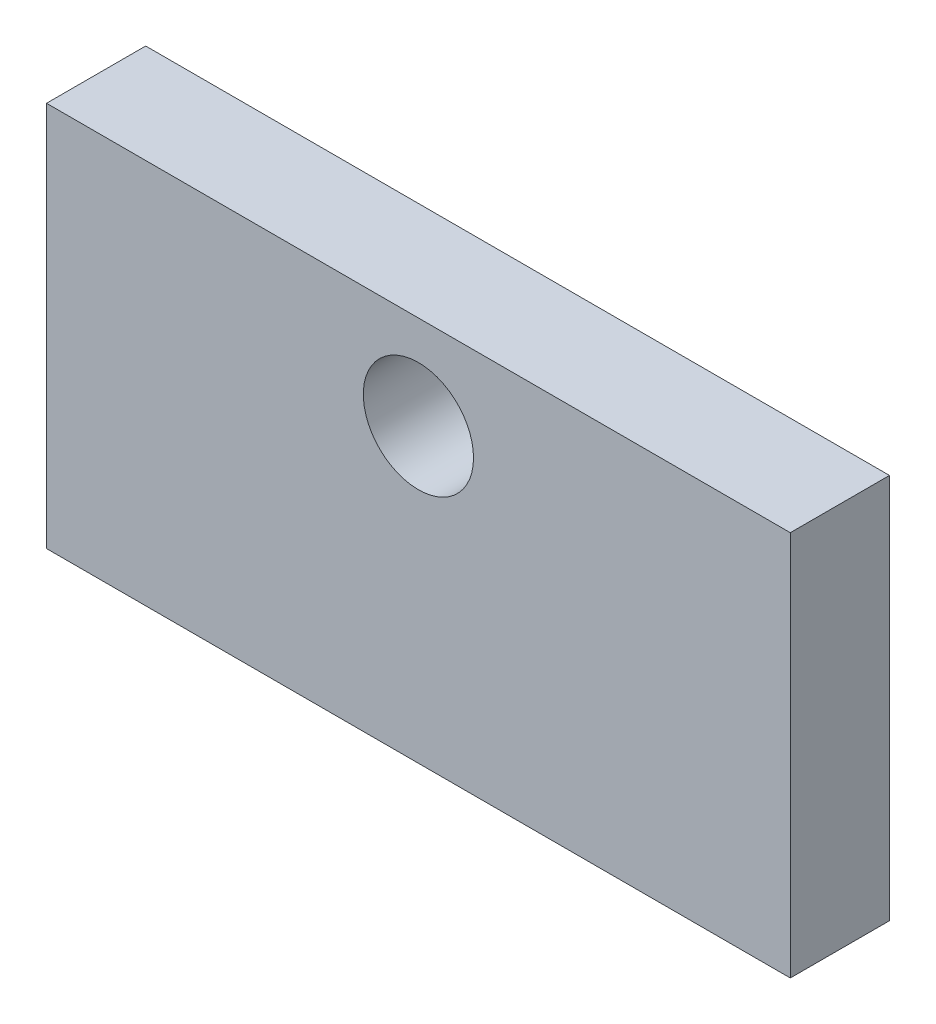
ISO-10303-21;
HEADER;
FILE_DESCRIPTION(('STEP AP214'),'2;1');
FILE_NAME('part.step','',(''),(''),'','','');
FILE_SCHEMA(('AUTOMOTIVE_DESIGN { 1 0 10303 214 1 1 1 1 }'));
ENDSEC;
DATA;
#1=APPLICATION_CONTEXT('core data for automotive mechanical design processes');
#2=APPLICATION_PROTOCOL_DEFINITION('international standard','automotive_design',2000,#1);
#3=PRODUCT_CONTEXT('',#1,'mechanical');
#4=PRODUCT('Part','Part','',(#3));
#5=PRODUCT_RELATED_PRODUCT_CATEGORY('part','',(#4));
#6=PRODUCT_DEFINITION_FORMATION('','',#4);
#7=PRODUCT_DEFINITION_CONTEXT('part definition',#1,'design');
#8=PRODUCT_DEFINITION('design','',#6,#7);
#9=PRODUCT_DEFINITION_SHAPE('','',#8);
#10=(LENGTH_UNIT() NAMED_UNIT(*) SI_UNIT(.MILLI.,.METRE.));
#11=(NAMED_UNIT(*) PLANE_ANGLE_UNIT() SI_UNIT($,.RADIAN.));
#12=(NAMED_UNIT(*) SI_UNIT($,.STERADIAN.) SOLID_ANGLE_UNIT());
#13=UNCERTAINTY_MEASURE_WITH_UNIT(LENGTH_MEASURE(1.E-05),#10,'distance_accuracy_value','');
#14=(GEOMETRIC_REPRESENTATION_CONTEXT(3) GLOBAL_UNCERTAINTY_ASSIGNED_CONTEXT((#13)) GLOBAL_UNIT_ASSIGNED_CONTEXT((#10,
#11,#12)) REPRESENTATION_CONTEXT('',''));
#15=CARTESIAN_POINT('',(0.,0.,0.));
#16=DIRECTION('',(0.,0.,1.));
#17=DIRECTION('',(1.,0.,0.));
#18=AXIS2_PLACEMENT_3D('',#15,#16,#17);
#19=CARTESIAN_POINT('',(135.,0.,18.));
#20=DIRECTION('',(0.,1.,0.));
#21=DIRECTION('',(-1.,0.,0.));
#22=AXIS2_PLACEMENT_3D('',#19,#20,#21);
#23=PLANE('',#22);
#24=DIRECTION('',(1.,0.,0.));
#25=VECTOR('',#24,1.);
#26=CARTESIAN_POINT('',(135.,0.,0.));
#27=LINE('',#26,#25);
#28=CARTESIAN_POINT('',(0.,0.,0.));
#29=VERTEX_POINT('',#28);
#30=CARTESIAN_POINT('',(135.,0.,0.));
#31=VERTEX_POINT('',#30);
#32=EDGE_CURVE('E107',#29,#31,#27,.T.);
#33=ORIENTED_EDGE('',*,*,#32,.T.);
#34=DIRECTION('',(0.,0.,-1.));
#35=VECTOR('',#34,1.);
#36=CARTESIAN_POINT('',(135.,0.,18.));
#37=LINE('',#36,#35);
#38=CARTESIAN_POINT('',(135.,0.,18.));
#39=VERTEX_POINT('',#38);
#40=EDGE_CURVE('E11',#39,#31,#37,.T.);
#41=ORIENTED_EDGE('',*,*,#40,.F.);
#42=DIRECTION('',(1.,0.,0.));
#43=VECTOR('',#42,1.);
#44=CARTESIAN_POINT('',(135.,0.,18.));
#45=LINE('',#44,#43);
#46=CARTESIAN_POINT('',(0.,0.,18.));
#47=VERTEX_POINT('',#46);
#48=EDGE_CURVE('E91',#47,#39,#45,.T.);
#49=ORIENTED_EDGE('',*,*,#48,.F.);
#50=DIRECTION('',(0.,0.,-1.));
#51=VECTOR('',#50,1.);
#52=CARTESIAN_POINT('',(0.,0.,18.));
#53=LINE('',#52,#51);
#54=EDGE_CURVE('E103',#47,#29,#53,.T.);
#55=ORIENTED_EDGE('',*,*,#54,.T.);
#56=EDGE_LOOP('',(#33,#41,#49,#55));
#57=FACE_BOUND('',#56,.T.);
#58=ADVANCED_FACE('F39',(#57),#23,.F.);
#59=CARTESIAN_POINT('',(135.,70.,18.));
#60=DIRECTION('',(-1.,0.,0.));
#61=DIRECTION('',(0.,0.,1.));
#62=AXIS2_PLACEMENT_3D('',#59,#60,#61);
#63=PLANE('',#62);
#64=DIRECTION('',(0.,1.,0.));
#65=VECTOR('',#64,1.);
#66=CARTESIAN_POINT('',(135.,70.,0.));
#67=LINE('',#66,#65);
#68=CARTESIAN_POINT('',(135.,70.,0.));
#69=VERTEX_POINT('',#68);
#70=EDGE_CURVE('E96',#31,#69,#67,.T.);
#71=ORIENTED_EDGE('',*,*,#70,.T.);
#72=DIRECTION('',(0.,0.,-1.));
#73=VECTOR('',#72,1.);
#74=CARTESIAN_POINT('',(135.,70.,18.));
#75=LINE('',#74,#73);
#76=CARTESIAN_POINT('',(135.,70.,18.));
#77=VERTEX_POINT('',#76);
#78=EDGE_CURVE('E48',#77,#69,#75,.T.);
#79=ORIENTED_EDGE('',*,*,#78,.F.);
#80=DIRECTION('',(0.,1.,0.));
#81=VECTOR('',#80,1.);
#82=CARTESIAN_POINT('',(135.,70.,18.));
#83=LINE('',#82,#81);
#84=EDGE_CURVE('E86',#39,#77,#83,.T.);
#85=ORIENTED_EDGE('',*,*,#84,.F.);
#86=ORIENTED_EDGE('',*,*,#40,.T.);
#87=EDGE_LOOP('',(#71,#79,#85,#86));
#88=FACE_BOUND('',#87,.T.);
#89=ADVANCED_FACE('F95',(#88),#63,.F.);
#90=CARTESIAN_POINT('',(0.,70.,18.));
#91=DIRECTION('',(0.,-1.,0.));
#92=DIRECTION('',(0.,0.,-1.));
#93=AXIS2_PLACEMENT_3D('',#90,#91,#92);
#94=PLANE('',#93);
#95=DIRECTION('',(-1.,0.,0.));
#96=VECTOR('',#95,1.);
#97=CARTESIAN_POINT('',(0.,70.,0.));
#98=LINE('',#97,#96);
#99=CARTESIAN_POINT('',(0.,70.,0.));
#100=VERTEX_POINT('',#99);
#101=EDGE_CURVE('E73',#69,#100,#98,.T.);
#102=ORIENTED_EDGE('',*,*,#101,.T.);
#103=DIRECTION('',(0.,0.,-1.));
#104=VECTOR('',#103,1.);
#105=CARTESIAN_POINT('',(0.,70.,18.));
#106=LINE('',#105,#104);
#107=CARTESIAN_POINT('',(0.,70.,18.));
#108=VERTEX_POINT('',#107);
#109=EDGE_CURVE('E98',#108,#100,#106,.T.);
#110=ORIENTED_EDGE('',*,*,#109,.F.);
#111=DIRECTION('',(-1.,0.,0.));
#112=VECTOR('',#111,1.);
#113=CARTESIAN_POINT('',(0.,70.,18.));
#114=LINE('',#113,#112);
#115=EDGE_CURVE('E89',#77,#108,#114,.T.);
#116=ORIENTED_EDGE('',*,*,#115,.F.);
#117=ORIENTED_EDGE('',*,*,#78,.T.);
#118=EDGE_LOOP('',(#102,#110,#116,#117));
#119=FACE_BOUND('',#118,.T.);
#120=ADVANCED_FACE('F99',(#119),#94,.F.);
#121=CARTESIAN_POINT('',(0.,0.,18.));
#122=DIRECTION('',(1.,0.,0.));
#123=DIRECTION('',(0.,0.,-1.));
#124=AXIS2_PLACEMENT_3D('',#121,#122,#123);
#125=PLANE('',#124);
#126=DIRECTION('',(0.,-1.,0.));
#127=VECTOR('',#126,1.);
#128=CARTESIAN_POINT('',(0.,0.,0.));
#129=LINE('',#128,#127);
#130=EDGE_CURVE('E79',#100,#29,#129,.T.);
#131=ORIENTED_EDGE('',*,*,#130,.T.);
#132=ORIENTED_EDGE('',*,*,#54,.F.);
#133=DIRECTION('',(0.,-1.,0.));
#134=VECTOR('',#133,1.);
#135=CARTESIAN_POINT('',(0.,0.,18.));
#136=LINE('',#135,#134);
#137=EDGE_CURVE('E56',#108,#47,#136,.T.);
#138=ORIENTED_EDGE('',*,*,#137,.F.);
#139=ORIENTED_EDGE('',*,*,#109,.T.);
#140=EDGE_LOOP('',(#131,#132,#138,#139));
#141=FACE_BOUND('',#140,.T.);
#142=ADVANCED_FACE('F121',(#141),#125,.F.);
#143=CARTESIAN_POINT('',(0.,0.,18.));
#144=DIRECTION('',(0.,0.,-1.));
#145=DIRECTION('',(-1.,0.,0.));
#146=AXIS2_PLACEMENT_3D('',#143,#144,#145);
#147=PLANE('',#146);
#148=CARTESIAN_POINT('',(67.5,53.,18.));
#149=DIRECTION('',(0.,0.,1.));
#150=DIRECTION('',(1.,0.,0.));
#151=AXIS2_PLACEMENT_3D('',#148,#149,#150);
#152=CIRCLE('',#151,9.99999999999999);
#153=CARTESIAN_POINT('',(77.5,53.,18.));
#154=VERTEX_POINT('',#153);
#155=EDGE_CURVE('E128',#154,#154,#152,.T.);
#156=ORIENTED_EDGE('',*,*,#155,.F.);
#157=EDGE_LOOP('',(#156));
#158=FACE_BOUND('',#157,.T.);
#159=ORIENTED_EDGE('',*,*,#48,.T.);
#160=ORIENTED_EDGE('',*,*,#84,.T.);
#161=ORIENTED_EDGE('',*,*,#115,.T.);
#162=ORIENTED_EDGE('',*,*,#137,.T.);
#163=EDGE_LOOP('',(#159,#160,#161,#162));
#164=FACE_BOUND('',#163,.T.);
#165=ADVANCED_FACE('F87',(#158,#164),#147,.F.);
#166=CARTESIAN_POINT('',(0.,0.,0.));
#167=DIRECTION('',(0.,0.,-1.));
#168=DIRECTION('',(-1.,0.,0.));
#169=AXIS2_PLACEMENT_3D('',#166,#167,#168);
#170=PLANE('',#169);
#171=CARTESIAN_POINT('',(67.5,53.,0.));
#172=DIRECTION('',(0.,0.,1.));
#173=DIRECTION('',(1.,0.,0.));
#174=AXIS2_PLACEMENT_3D('',#171,#172,#173);
#175=CIRCLE('',#174,9.99999999999999);
#176=CARTESIAN_POINT('',(77.5,53.,0.));
#177=VERTEX_POINT('',#176);
#178=EDGE_CURVE('E111',#177,#177,#175,.T.);
#179=ORIENTED_EDGE('',*,*,#178,.T.);
#180=EDGE_LOOP('',(#179));
#181=FACE_BOUND('',#180,.T.);
#182=ORIENTED_EDGE('',*,*,#32,.F.);
#183=ORIENTED_EDGE('',*,*,#130,.F.);
#184=ORIENTED_EDGE('',*,*,#101,.F.);
#185=ORIENTED_EDGE('',*,*,#70,.F.);
#186=EDGE_LOOP('',(#182,#183,#184,#185));
#187=FACE_BOUND('',#186,.T.);
#188=ADVANCED_FACE('F124',(#181,#187),#170,.T.);
#189=CARTESIAN_POINT('',(67.5,53.,0.));
#190=DIRECTION('',(0.,0.,1.));
#191=DIRECTION('',(1.,0.,0.));
#192=AXIS2_PLACEMENT_3D('',#189,#190,#191);
#193=CYLINDRICAL_SURFACE('',#192,9.99999999999999);
#194=ORIENTED_EDGE('',*,*,#178,.F.);
#195=EDGE_LOOP('',(#194));
#196=FACE_BOUND('',#195,.T.);
#197=ORIENTED_EDGE('',*,*,#155,.T.);
#198=EDGE_LOOP('',(#197));
#199=FACE_BOUND('',#198,.T.);
#200=ADVANCED_FACE('F137',(#196,#199),#193,.F.);
#201=CLOSED_SHELL('',(#58,#89,#120,#142,#165,#188,#200));
#202=MANIFOLD_SOLID_BREP('B2',#201);
#203=ADVANCED_BREP_SHAPE_REPRESENTATION('',(#18,#202),#14);
#204=SHAPE_DEFINITION_REPRESENTATION(#9,#203);
ENDSEC;
END-ISO-10303-21;
